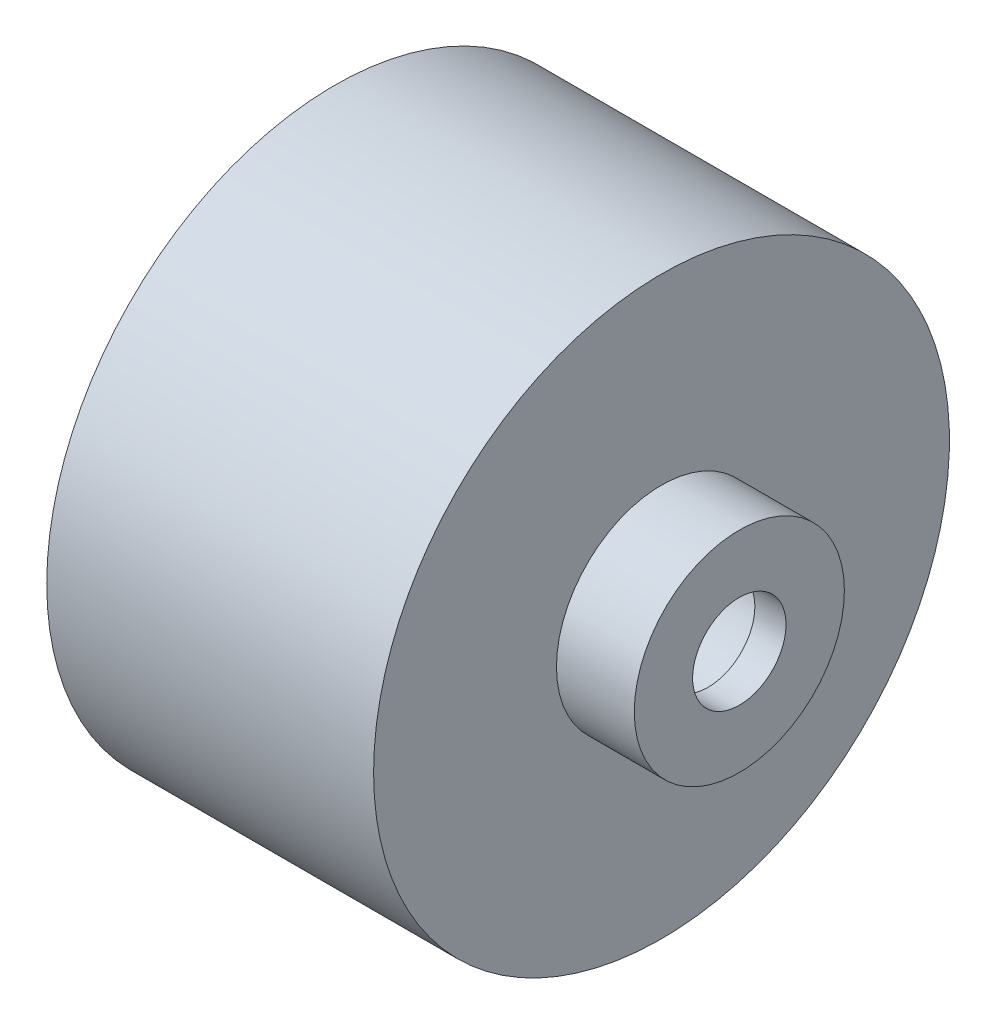
ISO-10303-21;
HEADER;
FILE_DESCRIPTION(('STEP AP214'),'2;1');
FILE_NAME('part.step','',(''),(''),'','','');
FILE_SCHEMA(('AUTOMOTIVE_DESIGN { 1 0 10303 214 1 1 1 1 }'));
ENDSEC;
DATA;
#1=APPLICATION_CONTEXT('core data for automotive mechanical design processes');
#2=APPLICATION_PROTOCOL_DEFINITION('international standard','automotive_design',2000,#1);
#3=PRODUCT_CONTEXT('',#1,'mechanical');
#4=PRODUCT('Part','Part','',(#3));
#5=PRODUCT_RELATED_PRODUCT_CATEGORY('part','',(#4));
#6=PRODUCT_DEFINITION_FORMATION('','',#4);
#7=PRODUCT_DEFINITION_CONTEXT('part definition',#1,'design');
#8=PRODUCT_DEFINITION('design','',#6,#7);
#9=PRODUCT_DEFINITION_SHAPE('','',#8);
#10=(LENGTH_UNIT() NAMED_UNIT(*) SI_UNIT(.MILLI.,.METRE.));
#11=(NAMED_UNIT(*) PLANE_ANGLE_UNIT() SI_UNIT($,.RADIAN.));
#12=(NAMED_UNIT(*) SI_UNIT($,.STERADIAN.) SOLID_ANGLE_UNIT());
#13=UNCERTAINTY_MEASURE_WITH_UNIT(LENGTH_MEASURE(1.E-05),#10,'distance_accuracy_value','');
#14=(GEOMETRIC_REPRESENTATION_CONTEXT(3) GLOBAL_UNCERTAINTY_ASSIGNED_CONTEXT((#13)) GLOBAL_UNIT_ASSIGNED_CONTEXT((#10,
#11,#12)) REPRESENTATION_CONTEXT('',''));
#15=CARTESIAN_POINT('',(0.,0.,0.));
#16=DIRECTION('',(0.,0.,1.));
#17=DIRECTION('',(1.,0.,0.));
#18=AXIS2_PLACEMENT_3D('',#15,#16,#17);
#19=CARTESIAN_POINT('',(21.,0.,0.));
#20=DIRECTION('',(-1.,0.,0.));
#21=DIRECTION('',(0.,0.,1.));
#22=AXIS2_PLACEMENT_3D('',#19,#20,#21);
#23=CYLINDRICAL_SURFACE('',#22,18.5);
#24=CARTESIAN_POINT('',(21.,0.,0.));
#25=DIRECTION('',(1.,0.,0.));
#26=DIRECTION('',(0.,0.,-1.));
#27=AXIS2_PLACEMENT_3D('',#24,#25,#26);
#28=CIRCLE('',#27,18.5);
#29=CARTESIAN_POINT('',(21.,0.,18.5));
#30=VERTEX_POINT('',#29);
#31=EDGE_CURVE('E39',#30,#30,#28,.T.);
#32=CARTESIAN_POINT('',(0.,0.,0.));
#33=DIRECTION('',(1.,0.,0.));
#34=DIRECTION('',(0.,0.,-1.));
#35=AXIS2_PLACEMENT_3D('',#32,#33,#34);
#36=CIRCLE('',#35,18.5);
#37=CARTESIAN_POINT('',(0.,0.,18.5));
#38=VERTEX_POINT('',#37);
#39=EDGE_CURVE('E44',#38,#38,#36,.T.);
#40=CARTESIAN_POINT('',(21.,0.,18.5));
#41=CARTESIAN_POINT('',(20.78125,0.,18.5));
#42=CARTESIAN_POINT('',(20.5625,0.,18.5));
#43=CARTESIAN_POINT('',(20.125,0.,18.5));
#44=CARTESIAN_POINT('',(19.90625,0.,18.5));
#45=CARTESIAN_POINT('',(19.46875,0.,18.5));
#46=CARTESIAN_POINT('',(19.25,0.,18.5));
#47=CARTESIAN_POINT('',(18.8125,0.,18.5));
#48=CARTESIAN_POINT('',(18.59375,0.,18.5));
#49=CARTESIAN_POINT('',(18.15625,0.,18.5));
#50=CARTESIAN_POINT('',(17.9375,0.,18.5));
#51=CARTESIAN_POINT('',(17.5,0.,18.5));
#52=CARTESIAN_POINT('',(17.28125,0.,18.5));
#53=CARTESIAN_POINT('',(16.84375,0.,18.5));
#54=CARTESIAN_POINT('',(16.625,0.,18.5));
#55=CARTESIAN_POINT('',(16.1875,0.,18.5));
#56=CARTESIAN_POINT('',(15.96875,0.,18.5));
#57=CARTESIAN_POINT('',(15.53125,0.,18.5));
#58=CARTESIAN_POINT('',(15.3125,0.,18.5));
#59=CARTESIAN_POINT('',(14.875,0.,18.5));
#60=CARTESIAN_POINT('',(14.65625,0.,18.5));
#61=CARTESIAN_POINT('',(14.21875,0.,18.5));
#62=CARTESIAN_POINT('',(14.,0.,18.5));
#63=CARTESIAN_POINT('',(13.5625,0.,18.5));
#64=CARTESIAN_POINT('',(13.34375,0.,18.5));
#65=CARTESIAN_POINT('',(12.90625,0.,18.5));
#66=CARTESIAN_POINT('',(12.6875,0.,18.5));
#67=CARTESIAN_POINT('',(12.25,0.,18.5));
#68=CARTESIAN_POINT('',(12.03125,0.,18.5));
#69=CARTESIAN_POINT('',(11.59375,0.,18.5));
#70=CARTESIAN_POINT('',(11.375,0.,18.5));
#71=CARTESIAN_POINT('',(10.9375,0.,18.5));
#72=CARTESIAN_POINT('',(10.71875,0.,18.5));
#73=CARTESIAN_POINT('',(10.28125,0.,18.5));
#74=CARTESIAN_POINT('',(10.0625,0.,18.5));
#75=CARTESIAN_POINT('',(9.625,0.,18.5));
#76=CARTESIAN_POINT('',(9.40625,0.,18.5));
#77=CARTESIAN_POINT('',(8.96875,0.,18.5));
#78=CARTESIAN_POINT('',(8.75,0.,18.5));
#79=CARTESIAN_POINT('',(8.3125,0.,18.5));
#80=CARTESIAN_POINT('',(8.09375,0.,18.5));
#81=CARTESIAN_POINT('',(7.65625,0.,18.5));
#82=CARTESIAN_POINT('',(7.4375,0.,18.5));
#83=CARTESIAN_POINT('',(7.,0.,18.5));
#84=CARTESIAN_POINT('',(6.78125,0.,18.5));
#85=CARTESIAN_POINT('',(6.34375,0.,18.5));
#86=CARTESIAN_POINT('',(6.125,0.,18.5));
#87=CARTESIAN_POINT('',(5.6875,0.,18.5));
#88=CARTESIAN_POINT('',(5.46875,0.,18.5));
#89=CARTESIAN_POINT('',(5.03125,0.,18.5));
#90=CARTESIAN_POINT('',(4.8125,0.,18.5));
#91=CARTESIAN_POINT('',(4.375,0.,18.5));
#92=CARTESIAN_POINT('',(4.15625,0.,18.5));
#93=CARTESIAN_POINT('',(3.71875,0.,18.5));
#94=CARTESIAN_POINT('',(3.5,0.,18.5));
#95=CARTESIAN_POINT('',(3.0625,0.,18.5));
#96=CARTESIAN_POINT('',(2.84375,0.,18.5));
#97=CARTESIAN_POINT('',(2.40625,0.,18.5));
#98=CARTESIAN_POINT('',(2.1875,0.,18.5));
#99=CARTESIAN_POINT('',(1.75,0.,18.5));
#100=CARTESIAN_POINT('',(1.53125,0.,18.5));
#101=CARTESIAN_POINT('',(1.09375,0.,18.5));
#102=CARTESIAN_POINT('',(0.875000000000001,0.,18.5));
#103=CARTESIAN_POINT('',(0.4375,0.,18.5));
#104=CARTESIAN_POINT('',(0.21875,0.,18.5));
#105=CARTESIAN_POINT('',(0.,0.,18.5));
#106=B_SPLINE_CURVE_WITH_KNOTS('',3,(#40,#41,#42,#43,#44,#45,#46,#47,#48,#49,#50,#51,#52,#53,
#54,#55,#56,#57,#58,#59,#60,#61,#62,#63,#64,#65,#66,#67,#68,#69,#70,#71,#72,#73,#74,#75,#76,#77,
#78,#79,#80,#81,#82,#83,#84,#85,#86,#87,#88,#89,#90,#91,#92,#93,#94,#95,#96,#97,#98,#99,#100,
#101,#102,#103,#104,#105),.UNSPECIFIED.,.F.,.F.,(4,2,2,2,2,2,2,2,2,2,2,2,2,2,2,2,2,2,2,2,2,2,2,
2,2,2,2,2,2,2,2,2,4),(0.,0.656250000000001,1.3125,1.96875,2.625,3.28125,3.9375,4.59375,5.25,
5.90625,6.5625,7.21875,7.875,8.53125,9.1875,9.84375,10.5,11.15625,11.8125,12.46875,13.125,
13.78125,14.4375,15.09375,15.75,16.40625,17.0625,17.71875,18.375,19.03125,19.6875,20.34375,21.),.UNSPECIFIED.);
#107=EDGE_CURVE('BSEAM32',#30,#38,#106,.T.);
#108=ORIENTED_EDGE('',*,*,#31,.F.);
#109=ORIENTED_EDGE('',*,*,#39,.T.);
#110=ORIENTED_EDGE('',*,*,#107,.T.);
#111=ORIENTED_EDGE('',*,*,#107,.F.);
#112=EDGE_LOOP('',(#108,#110,#109,#111));
#113=FACE_BOUND('',#112,.T.);
#114=ADVANCED_FACE('F32',(#113),#23,.T.);
#115=CARTESIAN_POINT('',(21.,0.,0.));
#116=DIRECTION('',(1.,0.,0.));
#117=DIRECTION('',(0.,0.,-1.));
#118=AXIS2_PLACEMENT_3D('',#115,#116,#117);
#119=PLANE('',#118);
#120=CARTESIAN_POINT('',(21.,0.,0.));
#121=DIRECTION('',(1.,0.,0.));
#122=DIRECTION('',(0.,0.,-1.));
#123=AXIS2_PLACEMENT_3D('',#120,#121,#122);
#124=CIRCLE('',#123,6.75);
#125=CARTESIAN_POINT('',(21.,0.,-6.75));
#126=VERTEX_POINT('',#125);
#127=EDGE_CURVE('E10',#126,#126,#124,.T.);
#128=ORIENTED_EDGE('',*,*,#127,.F.);
#129=EDGE_LOOP('',(#128));
#130=FACE_BOUND('',#129,.T.);
#131=ORIENTED_EDGE('',*,*,#31,.T.);
#132=EDGE_LOOP('',(#131));
#133=FACE_BOUND('',#132,.T.);
#134=ADVANCED_FACE('F91',(#130,#133),#119,.T.);
#135=CARTESIAN_POINT('',(0.,0.,0.));
#136=DIRECTION('',(1.,0.,0.));
#137=DIRECTION('',(0.,0.,-1.));
#138=AXIS2_PLACEMENT_3D('',#135,#136,#137);
#139=PLANE('',#138);
#140=CARTESIAN_POINT('',(0.,0.,0.));
#141=DIRECTION('',(1.,0.,0.));
#142=DIRECTION('',(0.,0.,-1.));
#143=AXIS2_PLACEMENT_3D('',#140,#141,#142);
#144=CIRCLE('',#143,16.5);
#145=CARTESIAN_POINT('',(0.,0.,16.5));
#146=VERTEX_POINT('',#145);
#147=EDGE_CURVE('E62',#146,#146,#144,.T.);
#148=ORIENTED_EDGE('',*,*,#147,.T.);
#149=EDGE_LOOP('',(#148));
#150=FACE_BOUND('',#149,.T.);
#151=ORIENTED_EDGE('',*,*,#39,.F.);
#152=EDGE_LOOP('',(#151));
#153=FACE_BOUND('',#152,.T.);
#154=ADVANCED_FACE('F71',(#150,#153),#139,.F.);
#155=CARTESIAN_POINT('',(26.,0.,0.));
#156=DIRECTION('',(-1.,0.,0.));
#157=DIRECTION('',(0.,0.,1.));
#158=AXIS2_PLACEMENT_3D('',#155,#156,#157);
#159=CYLINDRICAL_SURFACE('',#158,6.75);
#160=CARTESIAN_POINT('',(26.,0.,0.));
#161=DIRECTION('',(1.,0.,0.));
#162=DIRECTION('',(0.,0.,-1.));
#163=AXIS2_PLACEMENT_3D('',#160,#161,#162);
#164=CIRCLE('',#163,6.75);
#165=CARTESIAN_POINT('',(26.,0.,-6.75));
#166=VERTEX_POINT('',#165);
#167=EDGE_CURVE('E47',#166,#166,#164,.T.);
#168=ORIENTED_EDGE('',*,*,#167,.F.);
#169=EDGE_LOOP('',(#168));
#170=FACE_BOUND('',#169,.T.);
#171=ORIENTED_EDGE('',*,*,#127,.T.);
#172=EDGE_LOOP('',(#171));
#173=FACE_BOUND('',#172,.T.);
#174=ADVANCED_FACE('F86',(#170,#173),#159,.T.);
#175=CARTESIAN_POINT('',(26.,0.,0.));
#176=DIRECTION('',(1.,0.,0.));
#177=DIRECTION('',(0.,0.,-1.));
#178=AXIS2_PLACEMENT_3D('',#175,#176,#177);
#179=PLANE('',#178);
#180=CARTESIAN_POINT('',(26.,0.,0.));
#181=DIRECTION('',(1.,0.,0.));
#182=DIRECTION('',(0.,0.,-1.));
#183=AXIS2_PLACEMENT_3D('',#180,#181,#182);
#184=CIRCLE('',#183,3.);
#185=CARTESIAN_POINT('',(26.,0.,-3.));
#186=VERTEX_POINT('',#185);
#187=EDGE_CURVE('E176',#186,#186,#184,.T.);
#188=ORIENTED_EDGE('',*,*,#187,.F.);
#189=EDGE_LOOP('',(#188));
#190=FACE_BOUND('',#189,.T.);
#191=ORIENTED_EDGE('',*,*,#167,.T.);
#192=EDGE_LOOP('',(#191));
#193=FACE_BOUND('',#192,.T.);
#194=ADVANCED_FACE('F77',(#190,#193),#179,.T.);
#195=CARTESIAN_POINT('',(21.,0.,0.));
#196=DIRECTION('',(-1.,0.,0.));
#197=DIRECTION('',(0.,0.,1.));
#198=AXIS2_PLACEMENT_3D('',#195,#196,#197);
#199=CYLINDRICAL_SURFACE('',#198,16.5);
#200=CARTESIAN_POINT('',(19.,0.,0.));
#201=DIRECTION('',(1.,0.,0.));
#202=DIRECTION('',(0.,0.,-1.));
#203=AXIS2_PLACEMENT_3D('',#200,#201,#202);
#204=CIRCLE('',#203,16.5);
#205=CARTESIAN_POINT('',(19.,0.,16.5));
#206=VERTEX_POINT('',#205);
#207=EDGE_CURVE('E57',#206,#206,#204,.T.);
#208=CARTESIAN_POINT('',(19.,0.,16.5));
#209=CARTESIAN_POINT('',(18.8020833333333,0.,16.5));
#210=CARTESIAN_POINT('',(18.6041666666667,0.,16.5));
#211=CARTESIAN_POINT('',(18.2083333333333,0.,16.5));
#212=CARTESIAN_POINT('',(18.0104166666667,0.,16.5));
#213=CARTESIAN_POINT('',(17.6145833333333,0.,16.5));
#214=CARTESIAN_POINT('',(17.4166666666667,0.,16.5));
#215=CARTESIAN_POINT('',(17.0208333333333,0.,16.5));
#216=CARTESIAN_POINT('',(16.8229166666667,0.,16.5));
#217=CARTESIAN_POINT('',(16.4270833333333,0.,16.5));
#218=CARTESIAN_POINT('',(16.2291666666667,0.,16.5));
#219=CARTESIAN_POINT('',(15.8333333333333,0.,16.5));
#220=CARTESIAN_POINT('',(15.6354166666667,0.,16.5));
#221=CARTESIAN_POINT('',(15.2395833333333,0.,16.5));
#222=CARTESIAN_POINT('',(15.0416666666667,0.,16.5));
#223=CARTESIAN_POINT('',(14.6458333333333,0.,16.5));
#224=CARTESIAN_POINT('',(14.4479166666667,0.,16.5));
#225=CARTESIAN_POINT('',(14.0520833333333,0.,16.5));
#226=CARTESIAN_POINT('',(13.8541666666667,0.,16.5));
#227=CARTESIAN_POINT('',(13.4583333333333,0.,16.5));
#228=CARTESIAN_POINT('',(13.2604166666667,0.,16.5));
#229=CARTESIAN_POINT('',(12.8645833333333,0.,16.5));
#230=CARTESIAN_POINT('',(12.6666666666667,0.,16.5));
#231=CARTESIAN_POINT('',(12.2708333333333,0.,16.5));
#232=CARTESIAN_POINT('',(12.0729166666667,0.,16.5));
#233=CARTESIAN_POINT('',(11.6770833333333,0.,16.5));
#234=CARTESIAN_POINT('',(11.4791666666667,0.,16.5));
#235=CARTESIAN_POINT('',(11.0833333333333,0.,16.5));
#236=CARTESIAN_POINT('',(10.8854166666667,0.,16.5));
#237=CARTESIAN_POINT('',(10.4895833333333,0.,16.5));
#238=CARTESIAN_POINT('',(10.2916666666667,0.,16.5));
#239=CARTESIAN_POINT('',(9.89583333333333,0.,16.5));
#240=CARTESIAN_POINT('',(9.69791666666667,0.,16.5));
#241=CARTESIAN_POINT('',(9.30208333333333,0.,16.5));
#242=CARTESIAN_POINT('',(9.10416666666667,0.,16.5));
#243=CARTESIAN_POINT('',(8.70833333333333,0.,16.5));
#244=CARTESIAN_POINT('',(8.51041666666667,0.,16.5));
#245=CARTESIAN_POINT('',(8.11458333333333,0.,16.5));
#246=CARTESIAN_POINT('',(7.91666666666667,0.,16.5));
#247=CARTESIAN_POINT('',(7.52083333333333,0.,16.5));
#248=CARTESIAN_POINT('',(7.32291666666667,0.,16.5));
#249=CARTESIAN_POINT('',(6.92708333333333,0.,16.5));
#250=CARTESIAN_POINT('',(6.72916666666667,0.,16.5));
#251=CARTESIAN_POINT('',(6.33333333333333,0.,16.5));
#252=CARTESIAN_POINT('',(6.13541666666667,0.,16.5));
#253=CARTESIAN_POINT('',(5.73958333333333,0.,16.5));
#254=CARTESIAN_POINT('',(5.54166666666667,0.,16.5));
#255=CARTESIAN_POINT('',(5.14583333333333,0.,16.5));
#256=CARTESIAN_POINT('',(4.94791666666667,0.,16.5));
#257=CARTESIAN_POINT('',(4.55208333333333,0.,16.5));
#258=CARTESIAN_POINT('',(4.35416666666667,0.,16.5));
#259=CARTESIAN_POINT('',(3.95833333333333,0.,16.5));
#260=CARTESIAN_POINT('',(3.76041666666667,0.,16.5));
#261=CARTESIAN_POINT('',(3.36458333333333,0.,16.5));
#262=CARTESIAN_POINT('',(3.16666666666667,0.,16.5));
#263=CARTESIAN_POINT('',(2.77083333333333,0.,16.5));
#264=CARTESIAN_POINT('',(2.57291666666667,0.,16.5));
#265=CARTESIAN_POINT('',(2.17708333333334,0.,16.5));
#266=CARTESIAN_POINT('',(1.97916666666667,0.,16.5));
#267=CARTESIAN_POINT('',(1.58333333333333,0.,16.5));
#268=CARTESIAN_POINT('',(1.38541666666667,0.,16.5));
#269=CARTESIAN_POINT('',(0.989583333333334,0.,16.5));
#270=CARTESIAN_POINT('',(0.791666666666667,0.,16.5));
#271=CARTESIAN_POINT('',(0.395833333333334,0.,16.5));
#272=CARTESIAN_POINT('',(0.197916666666667,0.,16.5));
#273=CARTESIAN_POINT('',(0.,0.,16.5));
#274=B_SPLINE_CURVE_WITH_KNOTS('',3,(#208,#209,#210,#211,#212,#213,#214,#215,#216,#217,#218,
#219,#220,#221,#222,#223,#224,#225,#226,#227,#228,#229,#230,#231,#232,#233,#234,#235,#236,#237,
#238,#239,#240,#241,#242,#243,#244,#245,#246,#247,#248,#249,#250,#251,#252,#253,#254,#255,#256,
#257,#258,#259,#260,#261,#262,#263,#264,#265,#266,#267,#268,#269,#270,#271,#272,#273),
.UNSPECIFIED.,.F.,.F.,(4,2,2,2,2,2,2,2,2,2,2,2,2,2,2,2,2,2,2,2,2,2,2,2,2,2,2,2,2,2,2,2,4),(0.,
0.593750000000001,1.1875,1.78125,2.375,2.96875,3.5625,4.15625,4.75,5.34375,5.9375,6.53125,7.125,
7.71875,8.3125,8.90625,9.5,10.09375,10.6875,11.28125,11.875,12.46875,13.0625,13.65625,14.25,
14.84375,15.4375,16.03125,16.625,17.21875,17.8125,18.40625,19.),.UNSPECIFIED.);
#275=EDGE_CURVE('BSEAM74',#206,#146,#274,.T.);
#276=ORIENTED_EDGE('',*,*,#207,.T.);
#277=ORIENTED_EDGE('',*,*,#147,.F.);
#278=ORIENTED_EDGE('',*,*,#275,.T.);
#279=ORIENTED_EDGE('',*,*,#275,.F.);
#280=EDGE_LOOP('',(#276,#278,#277,#279));
#281=FACE_BOUND('',#280,.T.);
#282=ADVANCED_FACE('F74',(#281),#199,.F.);
#283=CARTESIAN_POINT('',(19.,0.,0.));
#284=DIRECTION('',(1.,0.,0.));
#285=DIRECTION('',(0.,0.,-1.));
#286=AXIS2_PLACEMENT_3D('',#283,#284,#285);
#287=PLANE('',#286);
#288=CARTESIAN_POINT('',(19.,0.,0.));
#289=DIRECTION('',(1.,0.,0.));
#290=DIRECTION('',(0.,0.,-1.));
#291=AXIS2_PLACEMENT_3D('',#288,#289,#290);
#292=CIRCLE('',#291,4.75);
#293=CARTESIAN_POINT('',(19.,0.,-4.75));
#294=VERTEX_POINT('',#293);
#295=EDGE_CURVE('E53',#294,#294,#292,.T.);
#296=ORIENTED_EDGE('',*,*,#295,.T.);
#297=EDGE_LOOP('',(#296));
#298=FACE_BOUND('',#297,.T.);
#299=ORIENTED_EDGE('',*,*,#207,.F.);
#300=EDGE_LOOP('',(#299));
#301=FACE_BOUND('',#300,.T.);
#302=ADVANCED_FACE('F76',(#298,#301),#287,.F.);
#303=CARTESIAN_POINT('',(26.,0.,0.));
#304=DIRECTION('',(-1.,0.,0.));
#305=DIRECTION('',(0.,0.,1.));
#306=AXIS2_PLACEMENT_3D('',#303,#304,#305);
#307=CYLINDRICAL_SURFACE('',#306,4.75);
#308=CARTESIAN_POINT('',(24.,0.,0.));
#309=DIRECTION('',(1.,0.,0.));
#310=DIRECTION('',(0.,0.,-1.));
#311=AXIS2_PLACEMENT_3D('',#308,#309,#310);
#312=CIRCLE('',#311,4.75);
#313=CARTESIAN_POINT('',(24.,0.,-4.75));
#314=VERTEX_POINT('',#313);
#315=EDGE_CURVE('E66',#314,#314,#312,.T.);
#316=ORIENTED_EDGE('',*,*,#315,.T.);
#317=EDGE_LOOP('',(#316));
#318=FACE_BOUND('',#317,.T.);
#319=ORIENTED_EDGE('',*,*,#295,.F.);
#320=EDGE_LOOP('',(#319));
#321=FACE_BOUND('',#320,.T.);
#322=ADVANCED_FACE('F84',(#318,#321),#307,.F.);
#323=CARTESIAN_POINT('',(24.,0.,0.));
#324=DIRECTION('',(1.,0.,0.));
#325=DIRECTION('',(0.,0.,-1.));
#326=AXIS2_PLACEMENT_3D('',#323,#324,#325);
#327=PLANE('',#326);
#328=CARTESIAN_POINT('',(24.,0.,0.));
#329=DIRECTION('',(1.,0.,0.));
#330=DIRECTION('',(0.,0.,-1.));
#331=AXIS2_PLACEMENT_3D('',#328,#329,#330);
#332=CIRCLE('',#331,3.);
#333=CARTESIAN_POINT('',(24.,0.,-3.));
#334=VERTEX_POINT('',#333);
#335=EDGE_CURVE('E35',#334,#334,#332,.T.);
#336=ORIENTED_EDGE('',*,*,#335,.T.);
#337=EDGE_LOOP('',(#336));
#338=FACE_BOUND('',#337,.T.);
#339=ORIENTED_EDGE('',*,*,#315,.F.);
#340=EDGE_LOOP('',(#339));
#341=FACE_BOUND('',#340,.T.);
#342=ADVANCED_FACE('F107',(#338,#341),#327,.F.);
#343=CARTESIAN_POINT('',(21.,0.,0.));
#344=DIRECTION('',(1.,0.,0.));
#345=DIRECTION('',(0.,0.,-1.));
#346=AXIS2_PLACEMENT_3D('',#343,#344,#345);
#347=CYLINDRICAL_SURFACE('',#346,3.);
#348=ORIENTED_EDGE('',*,*,#187,.T.);
#349=EDGE_LOOP('',(#348));
#350=FACE_BOUND('',#349,.T.);
#351=ORIENTED_EDGE('',*,*,#335,.F.);
#352=EDGE_LOOP('',(#351));
#353=FACE_BOUND('',#352,.T.);
#354=ADVANCED_FACE('F110',(#350,#353),#347,.F.);
#355=CLOSED_SHELL('',(#114,#134,#154,#174,#194,#282,#302,#322,#342,#354));
#356=MANIFOLD_SOLID_BREP('B2',#355);
#357=ADVANCED_BREP_SHAPE_REPRESENTATION('',(#18,#356),#14);
#358=SHAPE_DEFINITION_REPRESENTATION(#9,#357);
ENDSEC;
END-ISO-10303-21;
